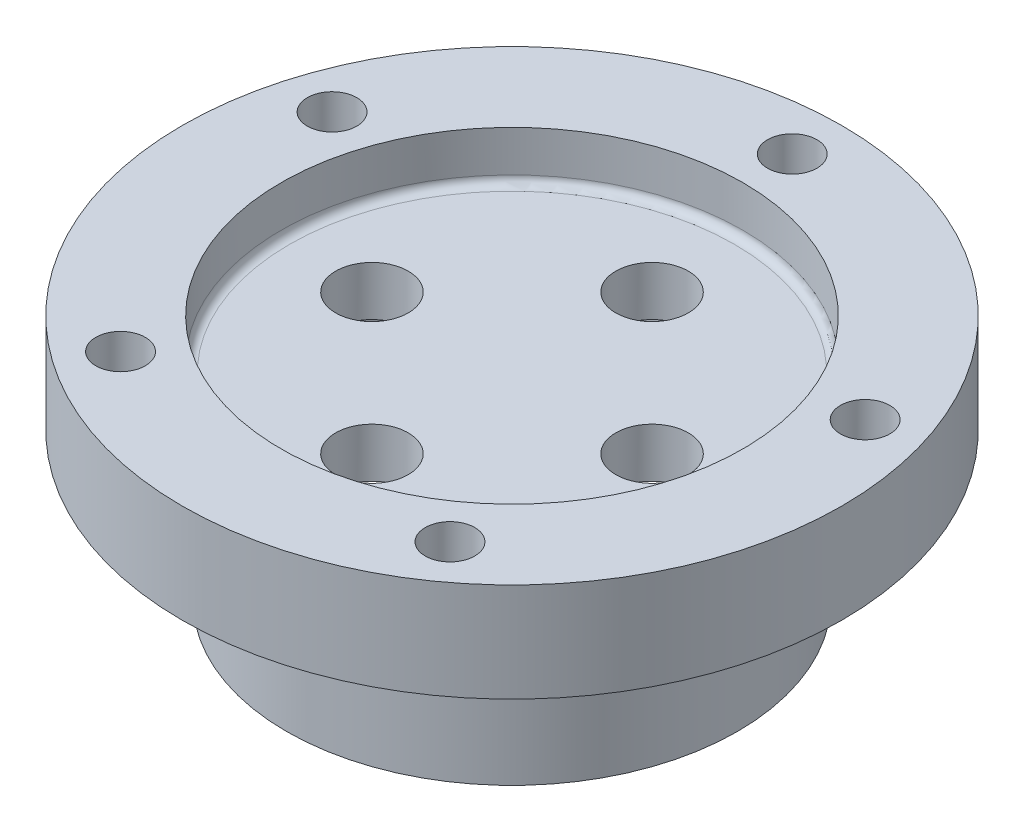
ISO-10303-21;
HEADER;
FILE_DESCRIPTION(('STEP AP214'),'2;1');
FILE_NAME('part.step','',(''),(''),'','','');
FILE_SCHEMA(('AUTOMOTIVE_DESIGN { 1 0 10303 214 1 1 1 1 }'));
ENDSEC;
DATA;
#1=APPLICATION_CONTEXT('core data for automotive mechanical design processes');
#2=APPLICATION_PROTOCOL_DEFINITION('international standard','automotive_design',2000,#1);
#3=PRODUCT_CONTEXT('',#1,'mechanical');
#4=PRODUCT('Part','Part','',(#3));
#5=PRODUCT_RELATED_PRODUCT_CATEGORY('part','',(#4));
#6=PRODUCT_DEFINITION_FORMATION('','',#4);
#7=PRODUCT_DEFINITION_CONTEXT('part definition',#1,'design');
#8=PRODUCT_DEFINITION('design','',#6,#7);
#9=PRODUCT_DEFINITION_SHAPE('','',#8);
#10=(LENGTH_UNIT() NAMED_UNIT(*) SI_UNIT(.MILLI.,.METRE.));
#11=(NAMED_UNIT(*) PLANE_ANGLE_UNIT() SI_UNIT($,.RADIAN.));
#12=(NAMED_UNIT(*) SI_UNIT($,.STERADIAN.) SOLID_ANGLE_UNIT());
#13=UNCERTAINTY_MEASURE_WITH_UNIT(LENGTH_MEASURE(1.E-05),#10,'distance_accuracy_value','');
#14=(GEOMETRIC_REPRESENTATION_CONTEXT(3) GLOBAL_UNCERTAINTY_ASSIGNED_CONTEXT((#13)) GLOBAL_UNIT_ASSIGNED_CONTEXT((#10,
#11,#12)) REPRESENTATION_CONTEXT('',''));
#15=CARTESIAN_POINT('',(0.,0.,0.));
#16=DIRECTION('',(0.,0.,1.));
#17=DIRECTION('',(1.,0.,0.));
#18=AXIS2_PLACEMENT_3D('',#15,#16,#17);
#19=CARTESIAN_POINT('',(-21.717,-14.2875,-1.51649000471313E-13));
#20=DIRECTION('',(0.,-1.,0.));
#21=DIRECTION('',(0.,0.,-1.));
#22=AXIS2_PLACEMENT_3D('',#19,#20,#21);
#23=PLANE('',#22);
#24=CARTESIAN_POINT('',(0.,-14.2875,0.));
#25=DIRECTION('',(0.,-1.,0.));
#26=DIRECTION('',(0.,0.,-1.));
#27=AXIS2_PLACEMENT_3D('',#24,#25,#26);
#28=CIRCLE('',#27,21.717);
#29=CARTESIAN_POINT('',(0.,-14.2875,-21.717));
#30=VERTEX_POINT('',#29);
#31=EDGE_CURVE('E105',#30,#30,#28,.T.);
#32=ORIENTED_EDGE('',*,*,#31,.T.);
#33=EDGE_LOOP('',(#32));
#34=FACE_BOUND('',#33,.T.);
#35=CARTESIAN_POINT('',(0.,-14.2875,0.));
#36=DIRECTION('',(0.,-1.,0.));
#37=DIRECTION('',(0.,0.,-1.));
#38=AXIS2_PLACEMENT_3D('',#35,#36,#37);
#39=CIRCLE('',#38,18.542);
#40=CARTESIAN_POINT('',(0.,-14.2875,-18.542));
#41=VERTEX_POINT('',#40);
#42=EDGE_CURVE('E60',#41,#41,#39,.T.);
#43=ORIENTED_EDGE('',*,*,#42,.F.);
#44=EDGE_LOOP('',(#43));
#45=FACE_BOUND('',#44,.T.);
#46=ADVANCED_FACE('F35',(#34,#45),#23,.T.);
#47=CARTESIAN_POINT('',(0.,0.,0.));
#48=DIRECTION('',(0.,-1.,0.));
#49=DIRECTION('',(0.,0.,-1.));
#50=AXIS2_PLACEMENT_3D('',#47,#48,#49);
#51=CYLINDRICAL_SURFACE('',#50,18.542);
#52=CARTESIAN_POINT('',(0.,-0.79375,0.));
#53=DIRECTION('',(0.,-1.,0.));
#54=DIRECTION('',(0.,0.,-1.));
#55=AXIS2_PLACEMENT_3D('',#52,#53,#54);
#56=CIRCLE('',#55,18.542);
#57=CARTESIAN_POINT('',(0.,-0.79375,-18.542));
#58=VERTEX_POINT('',#57);
#59=EDGE_CURVE('E49',#58,#58,#56,.F.);
#60=ORIENTED_EDGE('',*,*,#59,.T.);
#61=EDGE_LOOP('',(#60));
#62=FACE_BOUND('',#61,.T.);
#63=ORIENTED_EDGE('',*,*,#42,.T.);
#64=EDGE_LOOP('',(#63));
#65=FACE_BOUND('',#64,.T.);
#66=ADVANCED_FACE('F197',(#62,#65),#51,.F.);
#67=CARTESIAN_POINT('',(-18.542,0.,-1.29478093969659E-13));
#68=DIRECTION('',(0.,-1.,0.));
#69=DIRECTION('',(0.,0.,-1.));
#70=AXIS2_PLACEMENT_3D('',#67,#68,#69);
#71=PLANE('',#70);
#72=CARTESIAN_POINT('',(0.,0.,0.));
#73=DIRECTION('',(0.,-1.,0.));
#74=DIRECTION('',(0.,0.,-1.));
#75=AXIS2_PLACEMENT_3D('',#72,#73,#74);
#76=CIRCLE('',#75,17.74825);
#77=CARTESIAN_POINT('',(0.,0.,-17.74825));
#78=VERTEX_POINT('',#77);
#79=EDGE_CURVE('E55',#78,#78,#76,.T.);
#80=ORIENTED_EDGE('',*,*,#79,.T.);
#81=EDGE_LOOP('',(#80));
#82=FACE_BOUND('',#81,.T.);
#83=CARTESIAN_POINT('',(0.,0.,-13.4874));
#84=DIRECTION('',(0.,-1.,0.));
#85=DIRECTION('',(0.,0.,-1.));
#86=AXIS2_PLACEMENT_3D('',#83,#84,#85);
#87=CIRCLE('',#86,3.4925);
#88=CARTESIAN_POINT('',(0.,0.,-16.9799));
#89=VERTEX_POINT('',#88);
#90=EDGE_CURVE('E133',#89,#89,#87,.T.);
#91=ORIENTED_EDGE('',*,*,#90,.F.);
#92=EDGE_LOOP('',(#91));
#93=FACE_BOUND('',#92,.T.);
#94=CARTESIAN_POINT('',(13.4874,0.,0.));
#95=DIRECTION('',(0.,-1.,0.));
#96=DIRECTION('',(0.,0.,-1.));
#97=AXIS2_PLACEMENT_3D('',#94,#95,#96);
#98=CIRCLE('',#97,3.4925);
#99=CARTESIAN_POINT('',(13.4874,0.,-3.4925));
#100=VERTEX_POINT('',#99);
#101=EDGE_CURVE('E125',#100,#100,#98,.T.);
#102=ORIENTED_EDGE('',*,*,#101,.F.);
#103=EDGE_LOOP('',(#102));
#104=FACE_BOUND('',#103,.T.);
#105=CARTESIAN_POINT('',(0.,0.,13.4874));
#106=DIRECTION('',(0.,-1.,0.));
#107=DIRECTION('',(0.,0.,-1.));
#108=AXIS2_PLACEMENT_3D('',#105,#106,#107);
#109=CIRCLE('',#108,3.4925);
#110=CARTESIAN_POINT('',(0.,0.,9.9949));
#111=VERTEX_POINT('',#110);
#112=EDGE_CURVE('E117',#111,#111,#109,.T.);
#113=ORIENTED_EDGE('',*,*,#112,.F.);
#114=EDGE_LOOP('',(#113));
#115=FACE_BOUND('',#114,.T.);
#116=CARTESIAN_POINT('',(-13.4874,0.,0.));
#117=DIRECTION('',(0.,-1.,0.));
#118=DIRECTION('',(0.,0.,-1.));
#119=AXIS2_PLACEMENT_3D('',#116,#117,#118);
#120=CIRCLE('',#119,3.4925);
#121=CARTESIAN_POINT('',(-13.4874,0.,-3.4925));
#122=VERTEX_POINT('',#121);
#123=EDGE_CURVE('E109',#122,#122,#120,.T.);
#124=ORIENTED_EDGE('',*,*,#123,.F.);
#125=EDGE_LOOP('',(#124));
#126=FACE_BOUND('',#125,.T.);
#127=ADVANCED_FACE('F202',(#82,#93,#104,#115,#126),#71,.T.);
#128=CARTESIAN_POINT('',(0.,4.7625,0.));
#129=DIRECTION('',(0.,1.,0.));
#130=DIRECTION('',(0.,0.,1.));
#131=AXIS2_PLACEMENT_3D('',#128,#129,#130);
#132=PLANE('',#131);
#133=CARTESIAN_POINT('',(0.,4.7625,0.));
#134=DIRECTION('',(0.,1.,0.));
#135=DIRECTION('',(0.,0.,1.));
#136=AXIS2_PLACEMENT_3D('',#133,#134,#135);
#137=CIRCLE('',#136,21.43125);
#138=CARTESIAN_POINT('',(0.,4.7625,21.43125));
#139=VERTEX_POINT('',#138);
#140=EDGE_CURVE('E10',#139,#139,#137,.T.);
#141=ORIENTED_EDGE('',*,*,#140,.T.);
#142=EDGE_LOOP('',(#141));
#143=FACE_BOUND('',#142,.T.);
#144=CARTESIAN_POINT('',(0.,4.7625,-13.4874));
#145=DIRECTION('',(0.,1.,0.));
#146=DIRECTION('',(0.,0.,1.));
#147=AXIS2_PLACEMENT_3D('',#144,#145,#146);
#148=CIRCLE('',#147,3.4925);
#149=CARTESIAN_POINT('',(0.,4.7625,-9.9949));
#150=VERTEX_POINT('',#149);
#151=EDGE_CURVE('E86',#150,#150,#148,.T.);
#152=ORIENTED_EDGE('',*,*,#151,.F.);
#153=EDGE_LOOP('',(#152));
#154=FACE_BOUND('',#153,.T.);
#155=CARTESIAN_POINT('',(13.4874,4.7625,0.));
#156=DIRECTION('',(0.,1.,0.));
#157=DIRECTION('',(0.,0.,1.));
#158=AXIS2_PLACEMENT_3D('',#155,#156,#157);
#159=CIRCLE('',#158,3.4925);
#160=CARTESIAN_POINT('',(13.4874,4.7625,3.4925));
#161=VERTEX_POINT('',#160);
#162=EDGE_CURVE('E129',#161,#161,#159,.T.);
#163=ORIENTED_EDGE('',*,*,#162,.F.);
#164=EDGE_LOOP('',(#163));
#165=FACE_BOUND('',#164,.T.);
#166=CARTESIAN_POINT('',(0.,4.7625,13.4874));
#167=DIRECTION('',(0.,1.,0.));
#168=DIRECTION('',(0.,0.,1.));
#169=AXIS2_PLACEMENT_3D('',#166,#167,#168);
#170=CIRCLE('',#169,3.4925);
#171=CARTESIAN_POINT('',(0.,4.7625,16.9799));
#172=VERTEX_POINT('',#171);
#173=EDGE_CURVE('E121',#172,#172,#170,.T.);
#174=ORIENTED_EDGE('',*,*,#173,.F.);
#175=EDGE_LOOP('',(#174));
#176=FACE_BOUND('',#175,.T.);
#177=CARTESIAN_POINT('',(-13.4874,4.7625,0.));
#178=DIRECTION('',(0.,1.,0.));
#179=DIRECTION('',(0.,0.,1.));
#180=AXIS2_PLACEMENT_3D('',#177,#178,#179);
#181=CIRCLE('',#180,3.4925);
#182=CARTESIAN_POINT('',(-13.4874,4.7625,3.4925));
#183=VERTEX_POINT('',#182);
#184=EDGE_CURVE('E113',#183,#183,#181,.T.);
#185=ORIENTED_EDGE('',*,*,#184,.F.);
#186=EDGE_LOOP('',(#185));
#187=FACE_BOUND('',#186,.T.);
#188=ADVANCED_FACE('F208',(#143,#154,#165,#176,#187),#132,.T.);
#189=CARTESIAN_POINT('',(0.,0.,0.));
#190=DIRECTION('',(0.,-1.,0.));
#191=DIRECTION('',(0.,0.,-1.));
#192=AXIS2_PLACEMENT_3D('',#189,#190,#191);
#193=CYLINDRICAL_SURFACE('',#192,22.225);
#194=CARTESIAN_POINT('',(0.,5.55625,0.));
#195=DIRECTION('',(0.,1.,0.));
#196=DIRECTION('',(0.,0.,1.));
#197=AXIS2_PLACEMENT_3D('',#194,#195,#196);
#198=CIRCLE('',#197,22.225);
#199=CARTESIAN_POINT('',(0.,5.55625,22.225));
#200=VERTEX_POINT('',#199);
#201=EDGE_CURVE('E43',#200,#200,#198,.F.);
#202=ORIENTED_EDGE('',*,*,#201,.T.);
#203=EDGE_LOOP('',(#202));
#204=FACE_BOUND('',#203,.T.);
#205=CARTESIAN_POINT('',(0.,9.525,0.));
#206=DIRECTION('',(0.,-1.,0.));
#207=DIRECTION('',(0.,0.,-1.));
#208=AXIS2_PLACEMENT_3D('',#205,#206,#207);
#209=CIRCLE('',#208,22.225);
#210=CARTESIAN_POINT('',(0.,9.525,-22.225));
#211=VERTEX_POINT('',#210);
#212=EDGE_CURVE('E90',#211,#211,#209,.T.);
#213=ORIENTED_EDGE('',*,*,#212,.F.);
#214=EDGE_LOOP('',(#213));
#215=FACE_BOUND('',#214,.T.);
#216=ADVANCED_FACE('F162',(#204,#215),#193,.F.);
#217=CARTESIAN_POINT('',(-22.225,9.525,-1.55196345511577E-13));
#218=DIRECTION('',(0.,1.,0.));
#219=DIRECTION('',(0.,0.,1.));
#220=AXIS2_PLACEMENT_3D('',#217,#218,#219);
#221=PLANE('',#220);
#222=CARTESIAN_POINT('',(-25.6666377335154,9.525,-8.33959613569419));
#223=DIRECTION('',(0.,1.,0.));
#224=DIRECTION('',(0.95105651629515,0.,0.309016994374958));
#225=AXIS2_PLACEMENT_3D('',#222,#223,#224);
#226=CIRCLE('',#225,2.38125);
#227=CARTESIAN_POINT('',(-23.4019344040875,9.525,-7.60374941783882));
#228=VERTEX_POINT('',#227);
#229=EDGE_CURVE('E66',#228,#228,#226,.T.);
#230=ORIENTED_EDGE('',*,*,#229,.F.);
#231=EDGE_LOOP('',(#230));
#232=FACE_BOUND('',#231,.T.);
#233=CARTESIAN_POINT('',(-15.8628544962433,9.525,21.8333461356938));
#234=DIRECTION('',(0.,1.,0.));
#235=DIRECTION('',(0.58778525229248,0.,-0.809016994374942));
#236=AXIS2_PLACEMENT_3D('',#233,#234,#235);
#237=CIRCLE('',#236,2.38125);
#238=CARTESIAN_POINT('',(-14.4631908642218,9.525,19.9068744178384));
#239=VERTEX_POINT('',#238);
#240=EDGE_CURVE('E65',#239,#239,#237,.T.);
#241=ORIENTED_EDGE('',*,*,#240,.F.);
#242=EDGE_LOOP('',(#241));
#243=FACE_BOUND('',#242,.T.);
#244=CARTESIAN_POINT('',(15.862854496243,9.525,21.833346135694));
#245=DIRECTION('',(0.,1.,0.));
#246=DIRECTION('',(-0.587785252292469,0.,-0.809016994374951));
#247=AXIS2_PLACEMENT_3D('',#244,#245,#246);
#248=CIRCLE('',#247,2.38125);
#249=CARTESIAN_POINT('',(14.4631908642216,9.525,19.9068744178386));
#250=VERTEX_POINT('',#249);
#251=EDGE_CURVE('E71',#250,#250,#248,.T.);
#252=ORIENTED_EDGE('',*,*,#251,.F.);
#253=EDGE_LOOP('',(#252));
#254=FACE_BOUND('',#253,.T.);
#255=CARTESIAN_POINT('',(25.6666377335155,9.525,-8.33959613569382));
#256=DIRECTION('',(0.,1.,0.));
#257=DIRECTION('',(-0.951056516295155,0.,0.309016994374945));
#258=AXIS2_PLACEMENT_3D('',#255,#256,#257);
#259=CIRCLE('',#258,2.38125);
#260=CARTESIAN_POINT('',(23.4019344040876,9.525,-7.60374941783848));
#261=VERTEX_POINT('',#260);
#262=EDGE_CURVE('E76',#261,#261,#259,.T.);
#263=ORIENTED_EDGE('',*,*,#262,.F.);
#264=EDGE_LOOP('',(#263));
#265=FACE_BOUND('',#264,.T.);
#266=CARTESIAN_POINT('',(0.,9.525,-26.9875));
#267=DIRECTION('',(0.,1.,0.));
#268=DIRECTION('',(0.,0.,1.));
#269=AXIS2_PLACEMENT_3D('',#266,#267,#268);
#270=CIRCLE('',#269,2.38125);
#271=CARTESIAN_POINT('',(0.,9.525,-24.60625));
#272=VERTEX_POINT('',#271);
#273=EDGE_CURVE('E81',#272,#272,#270,.T.);
#274=ORIENTED_EDGE('',*,*,#273,.F.);
#275=EDGE_LOOP('',(#274));
#276=FACE_BOUND('',#275,.T.);
#277=ORIENTED_EDGE('',*,*,#212,.T.);
#278=EDGE_LOOP('',(#277));
#279=FACE_BOUND('',#278,.T.);
#280=CARTESIAN_POINT('',(0.,9.525,0.));
#281=DIRECTION('',(0.,-1.,0.));
#282=DIRECTION('',(0.,0.,-1.));
#283=AXIS2_PLACEMENT_3D('',#280,#281,#282);
#284=CIRCLE('',#283,31.75);
#285=CARTESIAN_POINT('',(0.,9.525,-31.75));
#286=VERTEX_POINT('',#285);
#287=EDGE_CURVE('E93',#286,#286,#284,.T.);
#288=ORIENTED_EDGE('',*,*,#287,.F.);
#289=EDGE_LOOP('',(#288));
#290=FACE_BOUND('',#289,.T.);
#291=ADVANCED_FACE('F158',(#232,#243,#254,#265,#276,#279,#290),#221,.T.);
#292=CARTESIAN_POINT('',(0.,0.,0.));
#293=DIRECTION('',(0.,-1.,0.));
#294=DIRECTION('',(0.,0.,-1.));
#295=AXIS2_PLACEMENT_3D('',#292,#293,#294);
#296=CYLINDRICAL_SURFACE('',#295,31.75);
#297=ORIENTED_EDGE('',*,*,#287,.T.);
#298=EDGE_LOOP('',(#297));
#299=FACE_BOUND('',#298,.T.);
#300=CARTESIAN_POINT('',(0.,0.,0.));
#301=DIRECTION('',(0.,-1.,0.));
#302=DIRECTION('',(0.,0.,-1.));
#303=AXIS2_PLACEMENT_3D('',#300,#301,#302);
#304=CIRCLE('',#303,31.75);
#305=CARTESIAN_POINT('',(0.,0.,-31.75));
#306=VERTEX_POINT('',#305);
#307=EDGE_CURVE('E97',#306,#306,#304,.T.);
#308=ORIENTED_EDGE('',*,*,#307,.F.);
#309=EDGE_LOOP('',(#308));
#310=FACE_BOUND('',#309,.T.);
#311=ADVANCED_FACE('F161',(#299,#310),#296,.T.);
#312=CARTESIAN_POINT('',(-31.75,0.,-2.21709065016539E-13));
#313=DIRECTION('',(0.,-1.,0.));
#314=DIRECTION('',(0.,0.,-1.));
#315=AXIS2_PLACEMENT_3D('',#312,#313,#314);
#316=PLANE('',#315);
#317=CARTESIAN_POINT('',(-25.6666377335154,0.,-8.33959613569419));
#318=DIRECTION('',(0.,-1.,0.));
#319=DIRECTION('',(0.,0.,-1.));
#320=AXIS2_PLACEMENT_3D('',#317,#318,#319);
#321=CIRCLE('',#320,2.38125);
#322=CARTESIAN_POINT('',(-25.6666377335154,0.,-10.7208461356942));
#323=VERTEX_POINT('',#322);
#324=EDGE_CURVE('E61',#323,#323,#321,.T.);
#325=ORIENTED_EDGE('',*,*,#324,.F.);
#326=EDGE_LOOP('',(#325));
#327=FACE_BOUND('',#326,.T.);
#328=CARTESIAN_POINT('',(-15.8628544962433,0.,21.8333461356938));
#329=DIRECTION('',(0.,-1.,0.));
#330=DIRECTION('',(0.,0.,-1.));
#331=AXIS2_PLACEMENT_3D('',#328,#329,#330);
#332=CIRCLE('',#331,2.38125);
#333=CARTESIAN_POINT('',(-15.8628544962433,0.,19.4520961356938));
#334=VERTEX_POINT('',#333);
#335=EDGE_CURVE('E67',#334,#334,#332,.T.);
#336=ORIENTED_EDGE('',*,*,#335,.F.);
#337=EDGE_LOOP('',(#336));
#338=FACE_BOUND('',#337,.T.);
#339=CARTESIAN_POINT('',(15.862854496243,0.,21.833346135694));
#340=DIRECTION('',(0.,-1.,0.));
#341=DIRECTION('',(0.,0.,-1.));
#342=AXIS2_PLACEMENT_3D('',#339,#340,#341);
#343=CIRCLE('',#342,2.38125);
#344=CARTESIAN_POINT('',(15.862854496243,0.,19.452096135694));
#345=VERTEX_POINT('',#344);
#346=EDGE_CURVE('E72',#345,#345,#343,.T.);
#347=ORIENTED_EDGE('',*,*,#346,.F.);
#348=EDGE_LOOP('',(#347));
#349=FACE_BOUND('',#348,.T.);
#350=CARTESIAN_POINT('',(25.6666377335155,0.,-8.33959613569382));
#351=DIRECTION('',(0.,-1.,0.));
#352=DIRECTION('',(0.,0.,-1.));
#353=AXIS2_PLACEMENT_3D('',#350,#351,#352);
#354=CIRCLE('',#353,2.38125);
#355=CARTESIAN_POINT('',(25.6666377335155,0.,-10.7208461356938));
#356=VERTEX_POINT('',#355);
#357=EDGE_CURVE('E77',#356,#356,#354,.T.);
#358=ORIENTED_EDGE('',*,*,#357,.F.);
#359=EDGE_LOOP('',(#358));
#360=FACE_BOUND('',#359,.T.);
#361=CARTESIAN_POINT('',(0.,0.,-26.9875));
#362=DIRECTION('',(0.,-1.,0.));
#363=DIRECTION('',(0.,0.,-1.));
#364=AXIS2_PLACEMENT_3D('',#361,#362,#363);
#365=CIRCLE('',#364,2.38125);
#366=CARTESIAN_POINT('',(0.,0.,-29.36875));
#367=VERTEX_POINT('',#366);
#368=EDGE_CURVE('E82',#367,#367,#365,.T.);
#369=ORIENTED_EDGE('',*,*,#368,.F.);
#370=EDGE_LOOP('',(#369));
#371=FACE_BOUND('',#370,.T.);
#372=ORIENTED_EDGE('',*,*,#307,.T.);
#373=EDGE_LOOP('',(#372));
#374=FACE_BOUND('',#373,.T.);
#375=CARTESIAN_POINT('',(0.,0.,0.));
#376=DIRECTION('',(0.,-1.,0.));
#377=DIRECTION('',(0.,0.,-1.));
#378=AXIS2_PLACEMENT_3D('',#375,#376,#377);
#379=CIRCLE('',#378,21.717);
#380=CARTESIAN_POINT('',(0.,0.,-21.717));
#381=VERTEX_POINT('',#380);
#382=EDGE_CURVE('E101',#381,#381,#379,.T.);
#383=ORIENTED_EDGE('',*,*,#382,.F.);
#384=EDGE_LOOP('',(#383));
#385=FACE_BOUND('',#384,.T.);
#386=ADVANCED_FACE('F178',(#327,#338,#349,#360,#371,#374,#385),#316,.T.);
#387=CARTESIAN_POINT('',(0.,0.,0.));
#388=DIRECTION('',(0.,-1.,0.));
#389=DIRECTION('',(0.,0.,-1.));
#390=AXIS2_PLACEMENT_3D('',#387,#388,#389);
#391=CYLINDRICAL_SURFACE('',#390,21.717);
#392=ORIENTED_EDGE('',*,*,#382,.T.);
#393=EDGE_LOOP('',(#392));
#394=FACE_BOUND('',#393,.T.);
#395=ORIENTED_EDGE('',*,*,#31,.F.);
#396=EDGE_LOOP('',(#395));
#397=FACE_BOUND('',#396,.T.);
#398=ADVANCED_FACE('F184',(#394,#397),#391,.T.);
#399=CARTESIAN_POINT('',(-13.4874,-14.2875,0.));
#400=DIRECTION('',(0.,1.,0.));
#401=DIRECTION('',(0.,0.,1.));
#402=AXIS2_PLACEMENT_3D('',#399,#400,#401);
#403=CYLINDRICAL_SURFACE('',#402,3.4925);
#404=ORIENTED_EDGE('',*,*,#123,.T.);
#405=EDGE_LOOP('',(#404));
#406=FACE_BOUND('',#405,.T.);
#407=ORIENTED_EDGE('',*,*,#184,.T.);
#408=EDGE_LOOP('',(#407));
#409=FACE_BOUND('',#408,.T.);
#410=ADVANCED_FACE('F191',(#406,#409),#403,.F.);
#411=CARTESIAN_POINT('',(0.,-14.2875,13.4874));
#412=DIRECTION('',(0.,1.,0.));
#413=DIRECTION('',(0.,0.,1.));
#414=AXIS2_PLACEMENT_3D('',#411,#412,#413);
#415=CYLINDRICAL_SURFACE('',#414,3.4925);
#416=ORIENTED_EDGE('',*,*,#112,.T.);
#417=EDGE_LOOP('',(#416));
#418=FACE_BOUND('',#417,.T.);
#419=ORIENTED_EDGE('',*,*,#173,.T.);
#420=EDGE_LOOP('',(#419));
#421=FACE_BOUND('',#420,.T.);
#422=ADVANCED_FACE('F237',(#418,#421),#415,.F.);
#423=CARTESIAN_POINT('',(13.4874,-14.2875,0.));
#424=DIRECTION('',(0.,1.,0.));
#425=DIRECTION('',(0.,0.,1.));
#426=AXIS2_PLACEMENT_3D('',#423,#424,#425);
#427=CYLINDRICAL_SURFACE('',#426,3.4925);
#428=ORIENTED_EDGE('',*,*,#101,.T.);
#429=EDGE_LOOP('',(#428));
#430=FACE_BOUND('',#429,.T.);
#431=ORIENTED_EDGE('',*,*,#162,.T.);
#432=EDGE_LOOP('',(#431));
#433=FACE_BOUND('',#432,.T.);
#434=ADVANCED_FACE('F250',(#430,#433),#427,.F.);
#435=CARTESIAN_POINT('',(0.,-14.2875,-13.4874));
#436=DIRECTION('',(0.,1.,0.));
#437=DIRECTION('',(0.,0.,1.));
#438=AXIS2_PLACEMENT_3D('',#435,#436,#437);
#439=CYLINDRICAL_SURFACE('',#438,3.4925);
#440=ORIENTED_EDGE('',*,*,#90,.T.);
#441=EDGE_LOOP('',(#440));
#442=FACE_BOUND('',#441,.T.);
#443=ORIENTED_EDGE('',*,*,#151,.T.);
#444=EDGE_LOOP('',(#443));
#445=FACE_BOUND('',#444,.T.);
#446=ADVANCED_FACE('F254',(#442,#445),#439,.F.);
#447=CARTESIAN_POINT('',(0.,-14.2875,-26.9875));
#448=DIRECTION('',(0.,1.,0.));
#449=DIRECTION('',(0.,0.,1.));
#450=AXIS2_PLACEMENT_3D('',#447,#448,#449);
#451=CYLINDRICAL_SURFACE('',#450,2.38125);
#452=ORIENTED_EDGE('',*,*,#368,.T.);
#453=EDGE_LOOP('',(#452));
#454=FACE_BOUND('',#453,.T.);
#455=ORIENTED_EDGE('',*,*,#273,.T.);
#456=EDGE_LOOP('',(#455));
#457=FACE_BOUND('',#456,.T.);
#458=ADVANCED_FACE('F258',(#454,#457),#451,.F.);
#459=CARTESIAN_POINT('',(25.6666377335155,-14.2875,-8.33959613569382));
#460=DIRECTION('',(0.,1.,0.));
#461=DIRECTION('',(0.,0.,1.));
#462=AXIS2_PLACEMENT_3D('',#459,#460,#461);
#463=CYLINDRICAL_SURFACE('',#462,2.38125);
#464=ORIENTED_EDGE('',*,*,#357,.T.);
#465=EDGE_LOOP('',(#464));
#466=FACE_BOUND('',#465,.T.);
#467=ORIENTED_EDGE('',*,*,#262,.T.);
#468=EDGE_LOOP('',(#467));
#469=FACE_BOUND('',#468,.T.);
#470=ADVANCED_FACE('F262',(#466,#469),#463,.F.);
#471=CARTESIAN_POINT('',(15.862854496243,-14.2875,21.833346135694));
#472=DIRECTION('',(0.,1.,0.));
#473=DIRECTION('',(0.,0.,1.));
#474=AXIS2_PLACEMENT_3D('',#471,#472,#473);
#475=CYLINDRICAL_SURFACE('',#474,2.38125);
#476=ORIENTED_EDGE('',*,*,#346,.T.);
#477=EDGE_LOOP('',(#476));
#478=FACE_BOUND('',#477,.T.);
#479=ORIENTED_EDGE('',*,*,#251,.T.);
#480=EDGE_LOOP('',(#479));
#481=FACE_BOUND('',#480,.T.);
#482=ADVANCED_FACE('F266',(#478,#481),#475,.F.);
#483=CARTESIAN_POINT('',(-15.8628544962433,-14.2875,21.8333461356938));
#484=DIRECTION('',(0.,1.,0.));
#485=DIRECTION('',(0.,0.,1.));
#486=AXIS2_PLACEMENT_3D('',#483,#484,#485);
#487=CYLINDRICAL_SURFACE('',#486,2.38125);
#488=ORIENTED_EDGE('',*,*,#335,.T.);
#489=EDGE_LOOP('',(#488));
#490=FACE_BOUND('',#489,.T.);
#491=ORIENTED_EDGE('',*,*,#240,.T.);
#492=EDGE_LOOP('',(#491));
#493=FACE_BOUND('',#492,.T.);
#494=ADVANCED_FACE('F220',(#490,#493),#487,.F.);
#495=CARTESIAN_POINT('',(-25.6666377335154,-14.2875,-8.33959613569419));
#496=DIRECTION('',(0.,1.,0.));
#497=DIRECTION('',(0.,0.,1.));
#498=AXIS2_PLACEMENT_3D('',#495,#496,#497);
#499=CYLINDRICAL_SURFACE('',#498,2.38125);
#500=ORIENTED_EDGE('',*,*,#324,.T.);
#501=EDGE_LOOP('',(#500));
#502=FACE_BOUND('',#501,.T.);
#503=ORIENTED_EDGE('',*,*,#229,.T.);
#504=EDGE_LOOP('',(#503));
#505=FACE_BOUND('',#504,.T.);
#506=ADVANCED_FACE('F156',(#502,#505),#499,.F.);
#507=CARTESIAN_POINT('',(0.,-0.79375,0.));
#508=DIRECTION('',(0.,-1.,0.));
#509=DIRECTION('',(0.,0.,-1.));
#510=AXIS2_PLACEMENT_3D('',#507,#508,#509);
#511=TOROIDAL_SURFACE('',#510,17.74825,0.79375);
#512=ORIENTED_EDGE('',*,*,#59,.F.);
#513=EDGE_LOOP('',(#512));
#514=FACE_BOUND('',#513,.T.);
#515=ORIENTED_EDGE('',*,*,#79,.F.);
#516=EDGE_LOOP('',(#515));
#517=FACE_BOUND('',#516,.T.);
#518=ADVANCED_FACE('F212',(#514,#517),#511,.F.);
#519=CARTESIAN_POINT('',(0.,5.55625,0.));
#520=DIRECTION('',(0.,1.,0.));
#521=DIRECTION('',(0.,0.,1.));
#522=AXIS2_PLACEMENT_3D('',#519,#520,#521);
#523=TOROIDAL_SURFACE('',#522,21.43125,0.79375);
#524=ORIENTED_EDGE('',*,*,#140,.F.);
#525=EDGE_LOOP('',(#524));
#526=FACE_BOUND('',#525,.T.);
#527=ORIENTED_EDGE('',*,*,#201,.F.);
#528=EDGE_LOOP('',(#527));
#529=FACE_BOUND('',#528,.T.);
#530=ADVANCED_FACE('F37',(#526,#529),#523,.F.);
#531=CLOSED_SHELL('',(#46,#66,#127,#188,#216,#291,#311,#386,#398,#410,#422,#434,#446,#458,#470,
#482,#494,#506,#518,#530));
#532=MANIFOLD_SOLID_BREP('B2',#531);
#533=ADVANCED_BREP_SHAPE_REPRESENTATION('',(#18,#532),#14);
#534=SHAPE_DEFINITION_REPRESENTATION(#9,#533);
ENDSEC;
END-ISO-10303-21;
